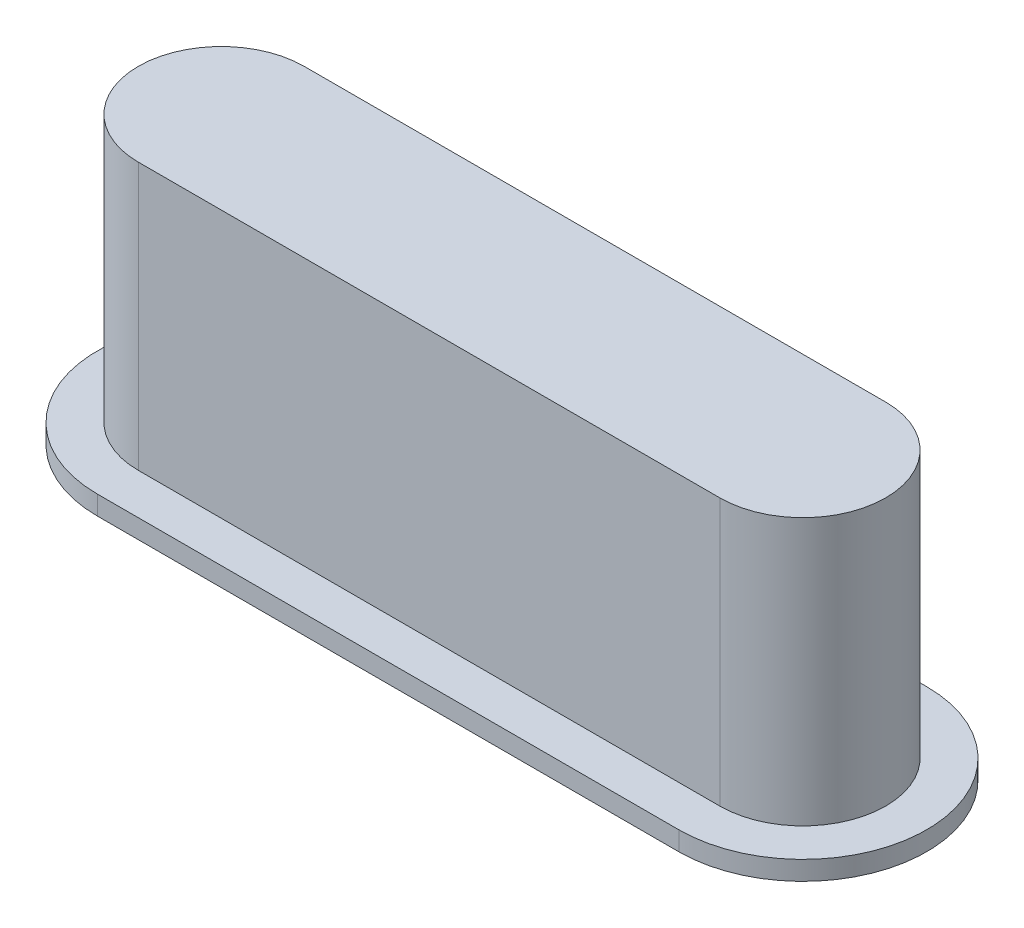
ISO-10303-21;
HEADER;
FILE_DESCRIPTION(('STEP AP214'),'2;1');
FILE_NAME('part.step','',(''),(''),'','','');
FILE_SCHEMA(('AUTOMOTIVE_DESIGN { 1 0 10303 214 1 1 1 1 }'));
ENDSEC;
DATA;
#1=APPLICATION_CONTEXT('core data for automotive mechanical design processes');
#2=APPLICATION_PROTOCOL_DEFINITION('international standard','automotive_design',2000,#1);
#3=PRODUCT_CONTEXT('',#1,'mechanical');
#4=PRODUCT('Part','Part','',(#3));
#5=PRODUCT_RELATED_PRODUCT_CATEGORY('part','',(#4));
#6=PRODUCT_DEFINITION_FORMATION('','',#4);
#7=PRODUCT_DEFINITION_CONTEXT('part definition',#1,'design');
#8=PRODUCT_DEFINITION('design','',#6,#7);
#9=PRODUCT_DEFINITION_SHAPE('','',#8);
#10=(LENGTH_UNIT() NAMED_UNIT(*) SI_UNIT(.MILLI.,.METRE.));
#11=(NAMED_UNIT(*) PLANE_ANGLE_UNIT() SI_UNIT($,.RADIAN.));
#12=(NAMED_UNIT(*) SI_UNIT($,.STERADIAN.) SOLID_ANGLE_UNIT());
#13=UNCERTAINTY_MEASURE_WITH_UNIT(LENGTH_MEASURE(1.E-05),#10,'distance_accuracy_value','');
#14=(GEOMETRIC_REPRESENTATION_CONTEXT(3) GLOBAL_UNCERTAINTY_ASSIGNED_CONTEXT((#13)) GLOBAL_UNIT_ASSIGNED_CONTEXT((#10,
#11,#12)) REPRESENTATION_CONTEXT('',''));
#15=CARTESIAN_POINT('',(0.,0.,0.));
#16=DIRECTION('',(0.,0.,1.));
#17=DIRECTION('',(1.,0.,0.));
#18=AXIS2_PLACEMENT_3D('',#15,#16,#17);
#19=CARTESIAN_POINT('',(-3.8735,3.556,0.));
#20=DIRECTION('',(0.,-1.,0.));
#21=DIRECTION('',(0.,0.,-1.));
#22=AXIS2_PLACEMENT_3D('',#19,#20,#21);
#23=CYLINDRICAL_SURFACE('',#22,1.1049);
#24=CARTESIAN_POINT('',(-3.8735,0.,0.));
#25=DIRECTION('',(0.,1.,0.));
#26=DIRECTION('',(0.,0.,1.));
#27=AXIS2_PLACEMENT_3D('',#24,#25,#26);
#28=CIRCLE('',#27,1.1049);
#29=CARTESIAN_POINT('',(-3.8735,0.,-1.1049));
#30=VERTEX_POINT('',#29);
#31=CARTESIAN_POINT('',(-3.8735,0.,1.1049));
#32=VERTEX_POINT('',#31);
#33=EDGE_CURVE('E136',#30,#32,#28,.T.);
#34=ORIENTED_EDGE('',*,*,#33,.T.);
#35=DIRECTION('',(0.,-1.,0.));
#36=VECTOR('',#35,1.);
#37=CARTESIAN_POINT('',(-3.8735,3.556,1.1049));
#38=LINE('',#37,#36);
#39=CARTESIAN_POINT('',(-3.8735,3.556,1.1049));
#40=VERTEX_POINT('',#39);
#41=EDGE_CURVE('E11',#40,#32,#38,.T.);
#42=ORIENTED_EDGE('',*,*,#41,.F.);
#43=CARTESIAN_POINT('',(-3.8735,3.556,0.));
#44=DIRECTION('',(0.,1.,0.));
#45=DIRECTION('',(0.,0.,1.));
#46=AXIS2_PLACEMENT_3D('',#43,#44,#45);
#47=CIRCLE('',#46,1.1049);
#48=CARTESIAN_POINT('',(-3.8735,3.556,-1.1049));
#49=VERTEX_POINT('',#48);
#50=EDGE_CURVE('E140',#49,#40,#47,.T.);
#51=ORIENTED_EDGE('',*,*,#50,.F.);
#52=DIRECTION('',(0.,-1.,0.));
#53=VECTOR('',#52,1.);
#54=CARTESIAN_POINT('',(-3.8735,3.556,-1.1049));
#55=LINE('',#54,#53);
#56=EDGE_CURVE('E148',#49,#30,#55,.T.);
#57=ORIENTED_EDGE('',*,*,#56,.T.);
#58=EDGE_LOOP('',(#34,#42,#51,#57));
#59=FACE_BOUND('',#58,.T.);
#60=ADVANCED_FACE('F37',(#59),#23,.T.);
#61=CARTESIAN_POINT('',(-3.8735,3.556,1.1049));
#62=DIRECTION('',(0.,0.,-1.));
#63=DIRECTION('',(-1.,0.,0.));
#64=AXIS2_PLACEMENT_3D('',#61,#62,#63);
#65=PLANE('',#64);
#66=DIRECTION('',(1.,0.,0.));
#67=VECTOR('',#66,1.);
#68=CARTESIAN_POINT('',(-3.8735,0.,1.1049));
#69=LINE('',#68,#67);
#70=CARTESIAN_POINT('',(3.8735,0.,1.1049));
#71=VERTEX_POINT('',#70);
#72=EDGE_CURVE('E151',#32,#71,#69,.T.);
#73=ORIENTED_EDGE('',*,*,#72,.T.);
#74=DIRECTION('',(0.,-1.,0.));
#75=VECTOR('',#74,1.);
#76=CARTESIAN_POINT('',(3.8735,3.556,1.1049));
#77=LINE('',#76,#75);
#78=CARTESIAN_POINT('',(3.8735,3.556,1.1049));
#79=VERTEX_POINT('',#78);
#80=EDGE_CURVE('E45',#79,#71,#77,.T.);
#81=ORIENTED_EDGE('',*,*,#80,.F.);
#82=DIRECTION('',(1.,0.,0.));
#83=VECTOR('',#82,1.);
#84=CARTESIAN_POINT('',(-3.8735,3.556,1.1049));
#85=LINE('',#84,#83);
#86=EDGE_CURVE('E142',#40,#79,#85,.T.);
#87=ORIENTED_EDGE('',*,*,#86,.F.);
#88=ORIENTED_EDGE('',*,*,#41,.T.);
#89=EDGE_LOOP('',(#73,#81,#87,#88));
#90=FACE_BOUND('',#89,.T.);
#91=ADVANCED_FACE('F171',(#90),#65,.F.);
#92=CARTESIAN_POINT('',(3.8735,3.556,0.));
#93=DIRECTION('',(0.,-1.,0.));
#94=DIRECTION('',(0.,0.,-1.));
#95=AXIS2_PLACEMENT_3D('',#92,#93,#94);
#96=CYLINDRICAL_SURFACE('',#95,1.1049);
#97=CARTESIAN_POINT('',(3.8735,0.,0.));
#98=DIRECTION('',(0.,1.,0.));
#99=DIRECTION('',(0.,0.,1.));
#100=AXIS2_PLACEMENT_3D('',#97,#98,#99);
#101=CIRCLE('',#100,1.1049);
#102=CARTESIAN_POINT('',(3.8735,0.,-1.1049));
#103=VERTEX_POINT('',#102);
#104=EDGE_CURVE('E154',#71,#103,#101,.T.);
#105=ORIENTED_EDGE('',*,*,#104,.T.);
#106=DIRECTION('',(0.,-1.,0.));
#107=VECTOR('',#106,1.);
#108=CARTESIAN_POINT('',(3.8735,3.556,-1.1049));
#109=LINE('',#108,#107);
#110=CARTESIAN_POINT('',(3.8735,3.556,-1.1049));
#111=VERTEX_POINT('',#110);
#112=EDGE_CURVE('E161',#111,#103,#109,.T.);
#113=ORIENTED_EDGE('',*,*,#112,.F.);
#114=CARTESIAN_POINT('',(3.8735,3.556,0.));
#115=DIRECTION('',(0.,1.,0.));
#116=DIRECTION('',(0.,0.,1.));
#117=AXIS2_PLACEMENT_3D('',#114,#115,#116);
#118=CIRCLE('',#117,1.1049);
#119=EDGE_CURVE('E145',#79,#111,#118,.T.);
#120=ORIENTED_EDGE('',*,*,#119,.F.);
#121=ORIENTED_EDGE('',*,*,#80,.T.);
#122=EDGE_LOOP('',(#105,#113,#120,#121));
#123=FACE_BOUND('',#122,.T.);
#124=ADVANCED_FACE('F167',(#123),#96,.T.);
#125=CARTESIAN_POINT('',(-3.8735,3.556,-1.1049));
#126=DIRECTION('',(0.,0.,1.));
#127=DIRECTION('',(1.,0.,0.));
#128=AXIS2_PLACEMENT_3D('',#125,#126,#127);
#129=PLANE('',#128);
#130=DIRECTION('',(-1.,0.,0.));
#131=VECTOR('',#130,1.);
#132=CARTESIAN_POINT('',(-3.8735,0.,-1.1049));
#133=LINE('',#132,#131);
#134=EDGE_CURVE('E143',#103,#30,#133,.T.);
#135=ORIENTED_EDGE('',*,*,#134,.T.);
#136=ORIENTED_EDGE('',*,*,#56,.F.);
#137=DIRECTION('',(-1.,0.,0.));
#138=VECTOR('',#137,1.);
#139=CARTESIAN_POINT('',(-3.8735,3.556,-1.1049));
#140=LINE('',#139,#138);
#141=EDGE_CURVE('E52',#111,#49,#140,.T.);
#142=ORIENTED_EDGE('',*,*,#141,.F.);
#143=ORIENTED_EDGE('',*,*,#112,.T.);
#144=EDGE_LOOP('',(#135,#136,#142,#143));
#145=FACE_BOUND('',#144,.T.);
#146=ADVANCED_FACE('F176',(#145),#129,.F.);
#147=CARTESIAN_POINT('',(-3.8735,3.556,0.));
#148=DIRECTION('',(0.,1.,0.));
#149=DIRECTION('',(0.,0.,1.));
#150=AXIS2_PLACEMENT_3D('',#147,#148,#149);
#151=PLANE('',#150);
#152=ORIENTED_EDGE('',*,*,#50,.T.);
#153=ORIENTED_EDGE('',*,*,#86,.T.);
#154=ORIENTED_EDGE('',*,*,#119,.T.);
#155=ORIENTED_EDGE('',*,*,#141,.T.);
#156=EDGE_LOOP('',(#152,#153,#154,#155));
#157=FACE_BOUND('',#156,.T.);
#158=ADVANCED_FACE('F179',(#157),#151,.T.);
#159=CARTESIAN_POINT('',(-3.8735,0.,0.));
#160=DIRECTION('',(0.,1.,0.));
#161=DIRECTION('',(0.,0.,1.));
#162=AXIS2_PLACEMENT_3D('',#159,#160,#161);
#163=PLANE('',#162);
#164=CARTESIAN_POINT('',(-3.8735,0.,0.));
#165=DIRECTION('',(0.,1.,0.));
#166=DIRECTION('',(0.,0.,1.));
#167=AXIS2_PLACEMENT_3D('',#164,#165,#166);
#168=CIRCLE('',#167,1.651);
#169=CARTESIAN_POINT('',(-3.8735,0.,-1.651));
#170=VERTEX_POINT('',#169);
#171=CARTESIAN_POINT('',(-3.8735,0.,1.651));
#172=VERTEX_POINT('',#171);
#173=EDGE_CURVE('E130',#170,#172,#168,.T.);
#174=ORIENTED_EDGE('',*,*,#173,.T.);
#175=DIRECTION('',(1.,0.,0.));
#176=VECTOR('',#175,1.);
#177=CARTESIAN_POINT('',(-3.8735,0.,1.651));
#178=LINE('',#177,#176);
#179=CARTESIAN_POINT('',(3.8735,0.,1.651));
#180=VERTEX_POINT('',#179);
#181=EDGE_CURVE('E102',#172,#180,#178,.T.);
#182=ORIENTED_EDGE('',*,*,#181,.T.);
#183=CARTESIAN_POINT('',(3.8735,0.,0.));
#184=DIRECTION('',(0.,1.,0.));
#185=DIRECTION('',(0.,0.,1.));
#186=AXIS2_PLACEMENT_3D('',#183,#184,#185);
#187=CIRCLE('',#186,1.651);
#188=CARTESIAN_POINT('',(3.8735,0.,-1.651));
#189=VERTEX_POINT('',#188);
#190=EDGE_CURVE('E125',#180,#189,#187,.T.);
#191=ORIENTED_EDGE('',*,*,#190,.T.);
#192=DIRECTION('',(-1.,0.,0.));
#193=VECTOR('',#192,1.);
#194=CARTESIAN_POINT('',(-3.8735,0.,-1.651));
#195=LINE('',#194,#193);
#196=EDGE_CURVE('E122',#189,#170,#195,.T.);
#197=ORIENTED_EDGE('',*,*,#196,.T.);
#198=EDGE_LOOP('',(#174,#182,#191,#197));
#199=FACE_BOUND('',#198,.T.);
#200=ORIENTED_EDGE('',*,*,#33,.F.);
#201=ORIENTED_EDGE('',*,*,#134,.F.);
#202=ORIENTED_EDGE('',*,*,#104,.F.);
#203=ORIENTED_EDGE('',*,*,#72,.F.);
#204=EDGE_LOOP('',(#200,#201,#202,#203));
#205=FACE_BOUND('',#204,.T.);
#206=ADVANCED_FACE('F174',(#199,#205),#163,.T.);
#207=CARTESIAN_POINT('',(-3.8735,-0.254,0.));
#208=DIRECTION('',(0.,1.,0.));
#209=DIRECTION('',(0.,0.,1.));
#210=AXIS2_PLACEMENT_3D('',#207,#208,#209);
#211=CYLINDRICAL_SURFACE('',#210,1.651);
#212=ORIENTED_EDGE('',*,*,#173,.F.);
#213=DIRECTION('',(0.,1.,0.));
#214=VECTOR('',#213,1.);
#215=CARTESIAN_POINT('',(-3.8735,-0.254,-1.651));
#216=LINE('',#215,#214);
#217=CARTESIAN_POINT('',(-3.8735,-0.254,-1.651));
#218=VERTEX_POINT('',#217);
#219=EDGE_CURVE('E121',#218,#170,#216,.T.);
#220=ORIENTED_EDGE('',*,*,#219,.F.);
#221=CARTESIAN_POINT('',(-3.8735,-0.254,0.));
#222=DIRECTION('',(0.,1.,0.));
#223=DIRECTION('',(0.,0.,1.));
#224=AXIS2_PLACEMENT_3D('',#221,#222,#223);
#225=CIRCLE('',#224,1.651);
#226=CARTESIAN_POINT('',(-3.8735,-0.254,1.651));
#227=VERTEX_POINT('',#226);
#228=EDGE_CURVE('E115',#218,#227,#225,.T.);
#229=ORIENTED_EDGE('',*,*,#228,.T.);
#230=DIRECTION('',(0.,1.,0.));
#231=VECTOR('',#230,1.);
#232=CARTESIAN_POINT('',(-3.8735,-0.254,1.651));
#233=LINE('',#232,#231);
#234=EDGE_CURVE('E97',#227,#172,#233,.T.);
#235=ORIENTED_EDGE('',*,*,#234,.T.);
#236=EDGE_LOOP('',(#212,#220,#229,#235));
#237=FACE_BOUND('',#236,.T.);
#238=ADVANCED_FACE('F120',(#237),#211,.T.);
#239=CARTESIAN_POINT('',(-3.8735,-0.254,-1.651));
#240=DIRECTION('',(0.,0.,-1.));
#241=DIRECTION('',(-1.,0.,0.));
#242=AXIS2_PLACEMENT_3D('',#239,#240,#241);
#243=PLANE('',#242);
#244=ORIENTED_EDGE('',*,*,#196,.F.);
#245=DIRECTION('',(0.,1.,0.));
#246=VECTOR('',#245,1.);
#247=CARTESIAN_POINT('',(3.8735,-0.254,-1.651));
#248=LINE('',#247,#246);
#249=CARTESIAN_POINT('',(3.8735,-0.254,-1.651));
#250=VERTEX_POINT('',#249);
#251=EDGE_CURVE('E137',#250,#189,#248,.T.);
#252=ORIENTED_EDGE('',*,*,#251,.F.);
#253=DIRECTION('',(-1.,0.,0.));
#254=VECTOR('',#253,1.);
#255=CARTESIAN_POINT('',(-3.8735,-0.254,-1.651));
#256=LINE('',#255,#254);
#257=EDGE_CURVE('E108',#250,#218,#256,.T.);
#258=ORIENTED_EDGE('',*,*,#257,.T.);
#259=ORIENTED_EDGE('',*,*,#219,.T.);
#260=EDGE_LOOP('',(#244,#252,#258,#259));
#261=FACE_BOUND('',#260,.T.);
#262=ADVANCED_FACE('F222',(#261),#243,.T.);
#263=CARTESIAN_POINT('',(3.8735,-0.254,0.));
#264=DIRECTION('',(0.,1.,0.));
#265=DIRECTION('',(0.,0.,1.));
#266=AXIS2_PLACEMENT_3D('',#263,#264,#265);
#267=CYLINDRICAL_SURFACE('',#266,1.651);
#268=ORIENTED_EDGE('',*,*,#190,.F.);
#269=DIRECTION('',(0.,1.,0.));
#270=VECTOR('',#269,1.);
#271=CARTESIAN_POINT('',(3.8735,-0.254,1.651));
#272=LINE('',#271,#270);
#273=CARTESIAN_POINT('',(3.8735,-0.254,1.651));
#274=VERTEX_POINT('',#273);
#275=EDGE_CURVE('E107',#274,#180,#272,.T.);
#276=ORIENTED_EDGE('',*,*,#275,.F.);
#277=CARTESIAN_POINT('',(3.8735,-0.254,0.));
#278=DIRECTION('',(0.,1.,0.));
#279=DIRECTION('',(0.,0.,1.));
#280=AXIS2_PLACEMENT_3D('',#277,#278,#279);
#281=CIRCLE('',#280,1.651);
#282=EDGE_CURVE('E118',#274,#250,#281,.T.);
#283=ORIENTED_EDGE('',*,*,#282,.T.);
#284=ORIENTED_EDGE('',*,*,#251,.T.);
#285=EDGE_LOOP('',(#268,#276,#283,#284));
#286=FACE_BOUND('',#285,.T.);
#287=ADVANCED_FACE('F231',(#286),#267,.T.);
#288=CARTESIAN_POINT('',(-3.8735,-0.254,1.651));
#289=DIRECTION('',(0.,0.,1.));
#290=DIRECTION('',(1.,0.,0.));
#291=AXIS2_PLACEMENT_3D('',#288,#289,#290);
#292=PLANE('',#291);
#293=ORIENTED_EDGE('',*,*,#181,.F.);
#294=ORIENTED_EDGE('',*,*,#234,.F.);
#295=DIRECTION('',(1.,0.,0.));
#296=VECTOR('',#295,1.);
#297=CARTESIAN_POINT('',(-3.8735,-0.254,1.651));
#298=LINE('',#297,#296);
#299=EDGE_CURVE('E100',#227,#274,#298,.T.);
#300=ORIENTED_EDGE('',*,*,#299,.T.);
#301=ORIENTED_EDGE('',*,*,#275,.T.);
#302=EDGE_LOOP('',(#293,#294,#300,#301));
#303=FACE_BOUND('',#302,.T.);
#304=ADVANCED_FACE('F99',(#303),#292,.T.);
#305=CARTESIAN_POINT('',(-3.8735,-0.254,0.));
#306=DIRECTION('',(0.,1.,0.));
#307=DIRECTION('',(0.,0.,1.));
#308=AXIS2_PLACEMENT_3D('',#305,#306,#307);
#309=PLANE('',#308);
#310=ORIENTED_EDGE('',*,*,#228,.F.);
#311=ORIENTED_EDGE('',*,*,#257,.F.);
#312=ORIENTED_EDGE('',*,*,#282,.F.);
#313=ORIENTED_EDGE('',*,*,#299,.F.);
#314=EDGE_LOOP('',(#310,#311,#312,#313));
#315=FACE_BOUND('',#314,.T.);
#316=ADVANCED_FACE('F113',(#315),#309,.F.);
#317=CLOSED_SHELL('',(#60,#91,#124,#146,#158,#206,#238,#262,#287,#304,#316));
#318=MANIFOLD_SOLID_BREP('B2',#317);
#319=ADVANCED_BREP_SHAPE_REPRESENTATION('',(#18,#318),#14);
#320=SHAPE_DEFINITION_REPRESENTATION(#9,#319);
ENDSEC;
END-ISO-10303-21;
